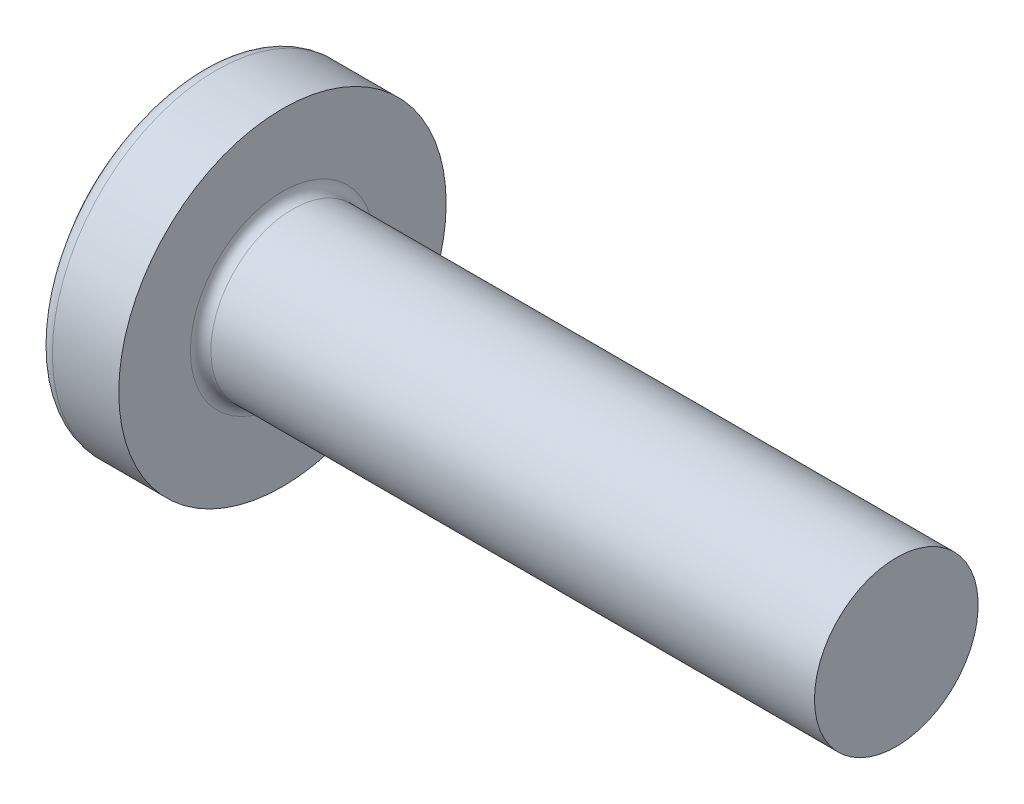
ISO-10303-21;
HEADER;
FILE_DESCRIPTION(('STEP AP214'),'2;1');
FILE_NAME('part.step','',(''),(''),'','','');
FILE_SCHEMA(('AUTOMOTIVE_DESIGN { 1 0 10303 214 1 1 1 1 }'));
ENDSEC;
DATA;
#1=APPLICATION_CONTEXT('core data for automotive mechanical design processes');
#2=APPLICATION_PROTOCOL_DEFINITION('international standard','automotive_design',2000,#1);
#3=PRODUCT_CONTEXT('',#1,'mechanical');
#4=PRODUCT('Part','Part','',(#3));
#5=PRODUCT_RELATED_PRODUCT_CATEGORY('part','',(#4));
#6=PRODUCT_DEFINITION_FORMATION('','',#4);
#7=PRODUCT_DEFINITION_CONTEXT('part definition',#1,'design');
#8=PRODUCT_DEFINITION('design','',#6,#7);
#9=PRODUCT_DEFINITION_SHAPE('','',#8);
#10=(LENGTH_UNIT() NAMED_UNIT(*) SI_UNIT(.MILLI.,.METRE.));
#11=(NAMED_UNIT(*) PLANE_ANGLE_UNIT() SI_UNIT($,.RADIAN.));
#12=(NAMED_UNIT(*) SI_UNIT($,.STERADIAN.) SOLID_ANGLE_UNIT());
#13=UNCERTAINTY_MEASURE_WITH_UNIT(LENGTH_MEASURE(1.E-05),#10,'distance_accuracy_value','');
#14=(GEOMETRIC_REPRESENTATION_CONTEXT(3) GLOBAL_UNCERTAINTY_ASSIGNED_CONTEXT((#13)) GLOBAL_UNIT_ASSIGNED_CONTEXT((#10,
#11,#12)) REPRESENTATION_CONTEXT('',''));
#15=CARTESIAN_POINT('',(0.,0.,0.));
#16=DIRECTION('',(0.,0.,1.));
#17=DIRECTION('',(1.,0.,0.));
#18=AXIS2_PLACEMENT_3D('',#15,#16,#17);
#19=CARTESIAN_POINT('',(2.5,0.,0.));
#20=DIRECTION('',(-1.,0.,0.));
#21=DIRECTION('',(0.,1.,0.));
#22=AXIS2_PLACEMENT_3D('',#19,#20,#21);
#23=SPHERICAL_SURFACE('',#22,2.5);
#24=CARTESIAN_POINT('',(0.532633828839689,0.,0.));
#25=DIRECTION('',(-1.,0.,0.));
#26=DIRECTION('',(0.,0.,1.));
#27=AXIS2_PLACEMENT_3D('',#24,#25,#26);
#28=CIRCLE('',#27,1.54255319148936);
#29=CARTESIAN_POINT('',(0.532633828839689,0.,1.54255319148936));
#30=VERTEX_POINT('',#29);
#31=EDGE_CURVE('E241',#30,#30,#28,.T.);
#32=ORIENTED_EDGE('',*,*,#31,.T.);
#33=EDGE_LOOP('',(#32));
#34=FACE_BOUND('',#33,.T.);
#35=CARTESIAN_POINT('',(0.0348536438778153,0.,0.));
#36=DIRECTION('',(1.,0.,0.));
#37=DIRECTION('',(0.,0.,-1.));
#38=AXIS2_PLACEMENT_3D('',#35,#36,#37);
#39=CIRCLE('',#38,0.415996926548163);
#40=CARTESIAN_POINT('',(0.0348536438778156,-0.239999999999999,-0.339784406495528));
#41=VERTEX_POINT('',#40);
#42=CARTESIAN_POINT('',(0.0348536438778153,-0.339784406495526,-0.24));
#43=VERTEX_POINT('',#42);
#44=EDGE_CURVE('E377',#41,#43,#39,.F.);
#45=ORIENTED_EDGE('',*,*,#44,.F.);
#46=CARTESIAN_POINT('',(2.5,-0.24,0.));
#47=DIRECTION('',(0.,1.,0.));
#48=DIRECTION('',(0.,0.,1.));
#49=AXIS2_PLACEMENT_3D('',#46,#47,#48);
#50=CIRCLE('',#49,2.48845333490504);
#51=CARTESIAN_POINT('',(0.12361367782094,-0.239999999999997,-0.738368504041365));
#52=VERTEX_POINT('',#51);
#53=EDGE_CURVE('E303',#52,#41,#50,.T.);
#54=ORIENTED_EDGE('',*,*,#53,.F.);
#55=CARTESIAN_POINT('',(2.32172308413752,0.,0.357568235162189));
#56=DIRECTION('',(0.446197753347436,0.,-0.894934391398443));
#57=DIRECTION('',(-0.894934391398443,0.,-0.446197753347436));
#58=AXIS2_PLACEMENT_3D('',#55,#56,#57);
#59=CIRCLE('',#58,2.46786594013402);
#60=CARTESIAN_POINT('',(0.12361367782094,0.240000000000003,-0.738368504041363));
#61=VERTEX_POINT('',#60);
#62=EDGE_CURVE('E275',#52,#61,#59,.T.);
#63=ORIENTED_EDGE('',*,*,#62,.T.);
#64=CARTESIAN_POINT('',(2.5,0.24,0.));
#65=DIRECTION('',(0.,-1.,0.));
#66=DIRECTION('',(0.,0.,-1.));
#67=AXIS2_PLACEMENT_3D('',#64,#65,#66);
#68=CIRCLE('',#67,2.48845333490504);
#69=CARTESIAN_POINT('',(0.0348536438778155,0.240000000000001,-0.339784406495526));
#70=VERTEX_POINT('',#69);
#71=EDGE_CURVE('E330',#70,#61,#68,.T.);
#72=ORIENTED_EDGE('',*,*,#71,.F.);
#73=CARTESIAN_POINT('',(0.0348536438778153,0.339784406495525,-0.24));
#74=VERTEX_POINT('',#73);
#75=EDGE_CURVE('E396',#74,#70,#39,.F.);
#76=ORIENTED_EDGE('',*,*,#75,.F.);
#77=CARTESIAN_POINT('',(2.5,0.,-0.24));
#78=DIRECTION('',(0.,0.,1.));
#79=DIRECTION('',(1.,0.,0.));
#80=AXIS2_PLACEMENT_3D('',#77,#78,#79);
#81=CIRCLE('',#80,2.48845333490504);
#82=CARTESIAN_POINT('',(0.12361367782094,0.738368504041364,-0.24));
#83=VERTEX_POINT('',#82);
#84=EDGE_CURVE('E269',#83,#74,#81,.T.);
#85=ORIENTED_EDGE('',*,*,#84,.F.);
#86=CARTESIAN_POINT('',(2.32172308413752,-0.357568235162189,0.));
#87=DIRECTION('',(0.446197753347436,0.894934391398443,0.));
#88=DIRECTION('',(-0.894934391398443,0.446197753347436,0.));
#89=AXIS2_PLACEMENT_3D('',#86,#87,#88);
#90=CIRCLE('',#89,2.46786594013402);
#91=CARTESIAN_POINT('',(0.12361367782094,0.738368504041364,0.24));
#92=VERTEX_POINT('',#91);
#93=EDGE_CURVE('E272',#83,#92,#90,.T.);
#94=ORIENTED_EDGE('',*,*,#93,.T.);
#95=CARTESIAN_POINT('',(2.5,0.,0.24));
#96=DIRECTION('',(0.,0.,-1.));
#97=DIRECTION('',(0.,1.,0.));
#98=AXIS2_PLACEMENT_3D('',#95,#96,#97);
#99=CIRCLE('',#98,2.48845333490504);
#100=CARTESIAN_POINT('',(0.0348536438778153,0.339784406495525,0.24));
#101=VERTEX_POINT('',#100);
#102=EDGE_CURVE('E265',#101,#92,#99,.T.);
#103=ORIENTED_EDGE('',*,*,#102,.F.);
#104=CARTESIAN_POINT('',(0.0348536438778156,0.239999999999999,0.339784406495528));
#105=VERTEX_POINT('',#104);
#106=EDGE_CURVE('E395',#105,#101,#39,.F.);
#107=ORIENTED_EDGE('',*,*,#106,.F.);
#108=CARTESIAN_POINT('',(0.12361367782094,0.239999999999997,0.738368504041365));
#109=VERTEX_POINT('',#108);
#110=EDGE_CURVE('E285',#109,#105,#68,.T.);
#111=ORIENTED_EDGE('',*,*,#110,.F.);
#112=CARTESIAN_POINT('',(2.32172308413752,0.,-0.357568235162189));
#113=DIRECTION('',(0.446197753347436,0.,0.894934391398443));
#114=DIRECTION('',(0.894934391398443,0.,-0.446197753347436));
#115=AXIS2_PLACEMENT_3D('',#112,#113,#114);
#116=CIRCLE('',#115,2.46786594013402);
#117=CARTESIAN_POINT('',(0.12361367782094,-0.240000000000002,0.738368504041363));
#118=VERTEX_POINT('',#117);
#119=EDGE_CURVE('E52',#109,#118,#116,.T.);
#120=ORIENTED_EDGE('',*,*,#119,.T.);
#121=CARTESIAN_POINT('',(0.0348536438778154,-0.240000000000001,0.339784406495526));
#122=VERTEX_POINT('',#121);
#123=EDGE_CURVE('E282',#122,#118,#50,.T.);
#124=ORIENTED_EDGE('',*,*,#123,.F.);
#125=CARTESIAN_POINT('',(0.0348536438778153,-0.339784406495526,0.24));
#126=VERTEX_POINT('',#125);
#127=EDGE_CURVE('E435',#126,#122,#39,.F.);
#128=ORIENTED_EDGE('',*,*,#127,.F.);
#129=CARTESIAN_POINT('',(0.12361367782094,-0.738368504041364,0.24));
#130=VERTEX_POINT('',#129);
#131=EDGE_CURVE('E266',#130,#126,#99,.T.);
#132=ORIENTED_EDGE('',*,*,#131,.F.);
#133=CARTESIAN_POINT('',(2.32172308413752,0.357568235162189,0.));
#134=DIRECTION('',(0.446197753347436,-0.894934391398443,0.));
#135=DIRECTION('',(0.894934391398443,0.446197753347436,0.));
#136=AXIS2_PLACEMENT_3D('',#133,#134,#135);
#137=CIRCLE('',#136,2.46786594013402);
#138=CARTESIAN_POINT('',(0.12361367782094,-0.738368504041364,-0.24));
#139=VERTEX_POINT('',#138);
#140=EDGE_CURVE('E262',#130,#139,#137,.T.);
#141=ORIENTED_EDGE('',*,*,#140,.T.);
#142=EDGE_CURVE('E67',#43,#139,#81,.T.);
#143=ORIENTED_EDGE('',*,*,#142,.F.);
#144=EDGE_LOOP('',(#45,#54,#63,#72,#76,#85,#94,#103,#107,#111,#120,#124,#128,#132,#141,#143));
#145=FACE_BOUND('',#144,.T.);
#146=ADVANCED_FACE('F38',(#34,#145),#23,.T.);
#147=CARTESIAN_POINT('',(0.,0.8,-0.24));
#148=DIRECTION('',(0.,0.,1.));
#149=DIRECTION('',(1.,0.,0.));
#150=AXIS2_PLACEMENT_3D('',#147,#148,#149);
#151=PLANE('',#150);
#152=ORIENTED_EDGE('',*,*,#84,.T.);
#153=CARTESIAN_POINT('',(-0.629305626090504,0.395285037112982,-0.24));
#154=CARTESIAN_POINT('',(-0.502245440869323,0.384885761504805,-0.24));
#155=CARTESIAN_POINT('',(-0.375193303991233,0.374386041200533,-0.24));
#156=CARTESIAN_POINT('',(-0.121109362358297,0.353102592236972,-0.24));
#157=CARTESIAN_POINT('',(0.00592244174753981,0.342318855839852,-0.24));
#158=CARTESIAN_POINT('',(0.259954553132912,0.320384813741064,-0.24));
#159=CARTESIAN_POINT('',(0.386954860411928,0.309234508033358,-0.24));
#160=CARTESIAN_POINT('',(0.640908035068628,0.286428502217992,-0.24));
#161=CARTESIAN_POINT('',(0.767860903211904,0.274772810656204,-0.24));
#162=CARTESIAN_POINT('',(1.02740505364566,0.25019581365541,-0.24));
#163=CARTESIAN_POINT('',(1.15999322223084,0.23724116727319,-0.24));
#164=CARTESIAN_POINT('',(1.35878055743683,0.216851377657761,-0.24));
#165=CARTESIAN_POINT('',(1.42502853887615,0.209894992147932,-0.24));
#166=CARTESIAN_POINT('',(1.55747716895954,0.195536747895868,-0.24));
#167=CARTESIAN_POINT('',(1.62367781680678,0.18813488182494,-0.24));
#168=CARTESIAN_POINT('',(1.68984631429487,0.180447253558898,-0.24));
#169=B_SPLINE_CURVE_WITH_KNOTS('',3,(#153,#154,#155,#156,#157,#158,#159,#160,#161,#162,#163,
#164,#165,#166,#167,#168),.UNSPECIFIED.,.F.,.F.,(4,2,2,2,2,2,2,4),(0.,0.382455333743982,
0.764921098031735,1.14738686861956,1.52984617438513,1.92950045825533,2.12933578679647,
2.32917440376968),.UNSPECIFIED.);
#170=CARTESIAN_POINT('',(0.9,0.262259890185289,-0.24));
#171=VERTEX_POINT('',#170);
#172=EDGE_CURVE('E419',#74,#171,#169,.T.);
#173=ORIENTED_EDGE('',*,*,#172,.T.);
#174=DIRECTION('',(0.,1.,0.));
#175=VECTOR('',#174,1.);
#176=CARTESIAN_POINT('',(0.9,-0.351276627792593,-0.24));
#177=LINE('',#176,#175);
#178=CARTESIAN_POINT('',(0.9,0.351276627792593,-0.24));
#179=VERTEX_POINT('',#178);
#180=EDGE_CURVE('E359',#171,#179,#177,.T.);
#181=ORIENTED_EDGE('',*,*,#180,.T.);
#182=DIRECTION('',(0.894934391398443,-0.446197753347436,0.));
#183=VECTOR('',#182,1.);
#184=CARTESIAN_POINT('',(0.,0.8,-0.24));
#185=LINE('',#184,#183);
#186=EDGE_CURVE('E242',#83,#179,#185,.T.);
#187=ORIENTED_EDGE('',*,*,#186,.F.);
#188=EDGE_LOOP('',(#152,#173,#181,#187));
#189=FACE_BOUND('',#188,.T.);
#190=ADVANCED_FACE('F197',(#189),#151,.T.);
#191=CARTESIAN_POINT('',(0.9,-0.351276627792593,-0.24));
#192=VERTEX_POINT('',#191);
#193=CARTESIAN_POINT('',(0.9,-0.262259890185289,-0.24));
#194=VERTEX_POINT('',#193);
#195=EDGE_CURVE('E250',#192,#194,#177,.T.);
#196=ORIENTED_EDGE('',*,*,#195,.T.);
#197=CARTESIAN_POINT('',(-0.629305626090504,-0.395285037112982,-0.24));
#198=CARTESIAN_POINT('',(-0.502245440869323,-0.384885761504805,-0.24));
#199=CARTESIAN_POINT('',(-0.375193303991233,-0.374386041200533,-0.24));
#200=CARTESIAN_POINT('',(-0.121109362358296,-0.353102592236972,-0.24));
#201=CARTESIAN_POINT('',(0.00592244174753997,-0.342318855839852,-0.24));
#202=CARTESIAN_POINT('',(0.259954553132912,-0.320384813741064,-0.24));
#203=CARTESIAN_POINT('',(0.386954860411928,-0.309234508033358,-0.24));
#204=CARTESIAN_POINT('',(0.640908035068629,-0.286428502217992,-0.24));
#205=CARTESIAN_POINT('',(0.767860903211904,-0.274772810656204,-0.24));
#206=CARTESIAN_POINT('',(1.02740505364565,-0.250195813655411,-0.24));
#207=CARTESIAN_POINT('',(1.15999322223082,-0.237241167273191,-0.24));
#208=CARTESIAN_POINT('',(1.35878055743681,-0.216851377657763,-0.24));
#209=CARTESIAN_POINT('',(1.42502853887612,-0.209894992147935,-0.24));
#210=CARTESIAN_POINT('',(1.55747716895951,-0.195536747895872,-0.24));
#211=CARTESIAN_POINT('',(1.62367781680675,-0.188134881824944,-0.24));
#212=CARTESIAN_POINT('',(1.68984631429483,-0.180447253558903,-0.24));
#213=B_SPLINE_CURVE_WITH_KNOTS('',3,(#197,#198,#199,#200,#201,#202,#203,#204,#205,#206,#207,
#208,#209,#210,#211,#212),.UNSPECIFIED.,.F.,.F.,(4,2,2,2,2,2,2,4),(0.,0.382455333743982,
0.764921098031735,1.14738686861956,1.52984617438513,1.92950045825531,2.12933578679643,
2.32917440376964),.UNSPECIFIED.);
#214=EDGE_CURVE('E394',#194,#43,#213,.F.);
#215=ORIENTED_EDGE('',*,*,#214,.T.);
#216=ORIENTED_EDGE('',*,*,#142,.T.);
#217=DIRECTION('',(0.894934391398443,0.446197753347436,0.));
#218=VECTOR('',#217,1.);
#219=CARTESIAN_POINT('',(0.,-0.8,-0.24));
#220=LINE('',#219,#218);
#221=EDGE_CURVE('E333',#139,#192,#220,.T.);
#222=ORIENTED_EDGE('',*,*,#221,.T.);
#223=EDGE_LOOP('',(#196,#215,#216,#222));
#224=FACE_BOUND('',#223,.T.);
#225=ADVANCED_FACE('F203',(#224),#151,.T.);
#226=CARTESIAN_POINT('',(0.,-0.799999999999999,0.24));
#227=DIRECTION('',(0.,0.,-1.));
#228=DIRECTION('',(0.,1.,0.));
#229=AXIS2_PLACEMENT_3D('',#226,#227,#228);
#230=PLANE('',#229);
#231=DIRECTION('',(0.,-1.,0.));
#232=VECTOR('',#231,1.);
#233=CARTESIAN_POINT('',(0.9,0.351276627792594,0.24));
#234=LINE('',#233,#232);
#235=CARTESIAN_POINT('',(0.9,0.351276627792593,0.24));
#236=VERTEX_POINT('',#235);
#237=CARTESIAN_POINT('',(0.9,0.262259890185289,0.24));
#238=VERTEX_POINT('',#237);
#239=EDGE_CURVE('E342',#236,#238,#234,.T.);
#240=ORIENTED_EDGE('',*,*,#239,.T.);
#241=CARTESIAN_POINT('',(-0.629305630567792,0.395285037479254,0.24));
#242=CARTESIAN_POINT('',(-0.502245444906562,0.384885761837513,0.24));
#243=CARTESIAN_POINT('',(-0.37519330758842,0.374386041499476,0.24));
#244=CARTESIAN_POINT('',(-0.121109365075988,0.353102592467066,0.24));
#245=CARTESIAN_POINT('',(0.00592243946929239,0.342318856034865,0.24));
#246=CARTESIAN_POINT('',(0.259954552394605,0.320384813806507,0.24));
#247=CARTESIAN_POINT('',(0.386954860773954,0.309234508002403,0.24));
#248=CARTESIAN_POINT('',(0.640908037631127,0.28642850198631,0.24));
#249=CARTESIAN_POINT('',(0.767860906874543,0.274772810320191,0.24));
#250=CARTESIAN_POINT('',(1.02740503497565,0.250195815411899,0.24));
#251=CARTESIAN_POINT('',(1.15999318014164,0.237241171372315,0.24));
#252=CARTESIAN_POINT('',(1.35878048026026,0.216851385682782,0.24));
#253=CARTESIAN_POINT('',(1.42502845000982,0.209895001550346,0.24));
#254=CARTESIAN_POINT('',(1.55747705673949,0.195536760284768,0.24));
#255=CARTESIAN_POINT('',(1.62367769292276,0.188134895822942,0.24));
#256=CARTESIAN_POINT('',(1.68984617876648,0.180447269328966,0.24));
#257=B_SPLINE_CURVE_WITH_KNOTS('',3,(#241,#242,#243,#244,#245,#246,#247,#248,#249,#250,#251,
#252,#253,#254,#255,#256),.UNSPECIFIED.,.F.,.F.,(4,2,2,2,2,2,2,4),(0.,0.382455335067977,
0.764921100678223,1.14738687457974,1.52984618366023,1.92950039692501,2.12933569015818,
2.32917427182042),.UNSPECIFIED.);
#258=EDGE_CURVE('E674',#238,#101,#257,.F.);
#259=ORIENTED_EDGE('',*,*,#258,.T.);
#260=ORIENTED_EDGE('',*,*,#102,.T.);
#261=DIRECTION('',(0.894934391398443,-0.446197753347436,0.));
#262=VECTOR('',#261,1.);
#263=CARTESIAN_POINT('',(0.,0.8,0.24));
#264=LINE('',#263,#262);
#265=EDGE_CURVE('E247',#92,#236,#264,.T.);
#266=ORIENTED_EDGE('',*,*,#265,.T.);
#267=EDGE_LOOP('',(#240,#259,#260,#266));
#268=FACE_BOUND('',#267,.T.);
#269=ADVANCED_FACE('F415',(#268),#230,.T.);
#270=ORIENTED_EDGE('',*,*,#131,.T.);
#271=CARTESIAN_POINT('',(-0.629305630567792,-0.395285037479254,0.24));
#272=CARTESIAN_POINT('',(-0.502245444906562,-0.384885761837513,0.24));
#273=CARTESIAN_POINT('',(-0.37519330758842,-0.374386041499476,0.24));
#274=CARTESIAN_POINT('',(-0.121109365075988,-0.353102592467066,0.24));
#275=CARTESIAN_POINT('',(0.00592243946929239,-0.342318856034865,0.24));
#276=CARTESIAN_POINT('',(0.259954552394605,-0.320384813806507,0.24));
#277=CARTESIAN_POINT('',(0.386954860773954,-0.309234508002403,0.24));
#278=CARTESIAN_POINT('',(0.640908037631127,-0.28642850198631,0.24));
#279=CARTESIAN_POINT('',(0.767860906874543,-0.274772810320191,0.24));
#280=CARTESIAN_POINT('',(1.02740503497565,-0.250195815411899,0.24));
#281=CARTESIAN_POINT('',(1.15999318014165,-0.237241171372315,0.24));
#282=CARTESIAN_POINT('',(1.35878048026027,-0.216851385682782,0.24));
#283=CARTESIAN_POINT('',(1.42502845000983,-0.209895001550345,0.24));
#284=CARTESIAN_POINT('',(1.55747705673949,-0.195536760284768,0.24));
#285=CARTESIAN_POINT('',(1.62367769292277,-0.188134895822941,0.24));
#286=CARTESIAN_POINT('',(1.68984617876649,-0.180447269328966,0.24));
#287=B_SPLINE_CURVE_WITH_KNOTS('',3,(#271,#272,#273,#274,#275,#276,#277,#278,#279,#280,#281,
#282,#283,#284,#285,#286),.UNSPECIFIED.,.F.,.F.,(4,2,2,2,2,2,2,4),(0.,0.382455335067977,
0.764921100678223,1.14738687457974,1.52984618366023,1.92950039692501,2.12933569015818,
2.32917427182042),.UNSPECIFIED.);
#288=CARTESIAN_POINT('',(0.9,-0.262259890185289,0.24));
#289=VERTEX_POINT('',#288);
#290=EDGE_CURVE('E436',#126,#289,#287,.T.);
#291=ORIENTED_EDGE('',*,*,#290,.T.);
#292=CARTESIAN_POINT('',(0.9,-0.351276627792593,0.24));
#293=VERTEX_POINT('',#292);
#294=EDGE_CURVE('E344',#289,#293,#234,.T.);
#295=ORIENTED_EDGE('',*,*,#294,.T.);
#296=DIRECTION('',(0.894934391398443,0.446197753347436,0.));
#297=VECTOR('',#296,1.);
#298=CARTESIAN_POINT('',(0.,-0.8,0.24));
#299=LINE('',#298,#297);
#300=EDGE_CURVE('E335',#130,#293,#299,.T.);
#301=ORIENTED_EDGE('',*,*,#300,.F.);
#302=EDGE_LOOP('',(#270,#291,#295,#301));
#303=FACE_BOUND('',#302,.T.);
#304=ADVANCED_FACE('F522',(#303),#230,.T.);
#305=CARTESIAN_POINT('',(0.9,0.351276627792594,0.24));
#306=DIRECTION('',(0.446197753347436,0.894934391398443,0.));
#307=DIRECTION('',(-0.894934391398443,0.446197753347436,0.));
#308=AXIS2_PLACEMENT_3D('',#305,#306,#307);
#309=PLANE('',#308);
#310=CARTESIAN_POINT('',(1.51667990224654,0.0438114218941496,0.));
#311=DIRECTION('',(0.446197753347436,0.894934391398443,0.));
#312=DIRECTION('',(-0.894934391398443,0.446197753347436,0.));
#313=AXIS2_PLACEMENT_3D('',#310,#311,#312);
#314=ELLIPSE('',#313,0.700087658673246,0.309289972496479);
#315=CARTESIAN_POINT('',(0.9,0.351276627792594,0.0546349775021752));
#316=VERTEX_POINT('',#315);
#317=CARTESIAN_POINT('',(0.9,0.351276627792594,-0.0546349775021753));
#318=VERTEX_POINT('',#317);
#319=EDGE_CURVE('E308',#316,#318,#314,.F.);
#320=ORIENTED_EDGE('',*,*,#319,.F.);
#321=DIRECTION('',(0.,0.,-1.));
#322=VECTOR('',#321,1.);
#323=CARTESIAN_POINT('',(0.9,0.351276627792594,0.24));
#324=LINE('',#323,#322);
#325=EDGE_CURVE('E345',#236,#316,#324,.T.);
#326=ORIENTED_EDGE('',*,*,#325,.F.);
#327=ORIENTED_EDGE('',*,*,#265,.F.);
#328=ORIENTED_EDGE('',*,*,#93,.F.);
#329=ORIENTED_EDGE('',*,*,#186,.T.);
#330=EDGE_CURVE('E347',#318,#179,#324,.T.);
#331=ORIENTED_EDGE('',*,*,#330,.F.);
#332=EDGE_LOOP('',(#320,#326,#327,#328,#329,#331));
#333=FACE_BOUND('',#332,.T.);
#334=ADVANCED_FACE('F413',(#333),#309,.F.);
#335=CARTESIAN_POINT('',(0.9,-0.351276627792593,-0.24));
#336=DIRECTION('',(0.446197753347436,-0.894934391398443,0.));
#337=DIRECTION('',(0.894934391398443,0.446197753347436,0.));
#338=AXIS2_PLACEMENT_3D('',#335,#336,#337);
#339=PLANE('',#338);
#340=CARTESIAN_POINT('',(1.51667990224654,-0.0438114218941494,0.));
#341=DIRECTION('',(0.446197753347436,-0.894934391398443,0.));
#342=DIRECTION('',(-0.894934391398443,-0.446197753347436,0.));
#343=AXIS2_PLACEMENT_3D('',#340,#341,#342);
#344=ELLIPSE('',#343,0.700087658673246,0.30928997249648);
#345=CARTESIAN_POINT('',(0.9,-0.351276627792594,-0.054634977502177));
#346=VERTEX_POINT('',#345);
#347=CARTESIAN_POINT('',(0.9,-0.351276627792594,0.0546349775021769));
#348=VERTEX_POINT('',#347);
#349=EDGE_CURVE('E676',#346,#348,#344,.F.);
#350=ORIENTED_EDGE('',*,*,#349,.F.);
#351=DIRECTION('',(0.,0.,1.));
#352=VECTOR('',#351,1.);
#353=CARTESIAN_POINT('',(0.9,-0.351276627792593,-0.24));
#354=LINE('',#353,#352);
#355=EDGE_CURVE('E338',#192,#346,#354,.T.);
#356=ORIENTED_EDGE('',*,*,#355,.F.);
#357=ORIENTED_EDGE('',*,*,#221,.F.);
#358=ORIENTED_EDGE('',*,*,#140,.F.);
#359=ORIENTED_EDGE('',*,*,#300,.T.);
#360=EDGE_CURVE('E341',#348,#293,#354,.T.);
#361=ORIENTED_EDGE('',*,*,#360,.F.);
#362=EDGE_LOOP('',(#350,#356,#357,#358,#359,#361));
#363=FACE_BOUND('',#362,.T.);
#364=ADVANCED_FACE('F509',(#363),#339,.F.);
#365=CARTESIAN_POINT('',(0.9,0.351276627792593,-0.24));
#366=DIRECTION('',(-1.,0.,0.));
#367=DIRECTION('',(0.,0.,1.));
#368=AXIS2_PLACEMENT_3D('',#365,#366,#367);
#369=PLANE('',#368);
#370=DIRECTION('',(0.,1.,0.));
#371=VECTOR('',#370,1.);
#372=CARTESIAN_POINT('',(0.9,-0.240000000000001,0.351276627792593));
#373=LINE('',#372,#371);
#374=CARTESIAN_POINT('',(0.9,-0.240000000000001,0.351276627792593));
#375=VERTEX_POINT('',#374);
#376=CARTESIAN_POINT('',(0.9,-0.0546349775021802,0.351276627792593));
#377=VERTEX_POINT('',#376);
#378=EDGE_CURVE('E323',#375,#377,#373,.T.);
#379=ORIENTED_EDGE('',*,*,#378,.T.);
#380=CARTESIAN_POINT('',(0.9,0.,0.));
#381=DIRECTION('',(-1.,0.,0.));
#382=DIRECTION('',(0.,0.,1.));
#383=AXIS2_PLACEMENT_3D('',#380,#381,#382);
#384=CIRCLE('',#383,0.3555);
#385=CARTESIAN_POINT('',(0.9,-0.240000000000001,0.262259890185289));
#386=VERTEX_POINT('',#385);
#387=EDGE_CURVE('E704',#386,#377,#384,.T.);
#388=ORIENTED_EDGE('',*,*,#387,.F.);
#389=DIRECTION('',(0.,0.,-1.));
#390=VECTOR('',#389,1.);
#391=CARTESIAN_POINT('',(0.9,-0.240000000000001,0.351276627792593));
#392=LINE('',#391,#390);
#393=EDGE_CURVE('E319',#375,#386,#392,.T.);
#394=ORIENTED_EDGE('',*,*,#393,.F.);
#395=EDGE_LOOP('',(#379,#388,#394));
#396=FACE_BOUND('',#395,.T.);
#397=ADVANCED_FACE('F502',(#396),#369,.T.);
#398=ORIENTED_EDGE('',*,*,#294,.F.);
#399=EDGE_CURVE('E709',#348,#289,#384,.T.);
#400=ORIENTED_EDGE('',*,*,#399,.F.);
#401=ORIENTED_EDGE('',*,*,#360,.T.);
#402=EDGE_LOOP('',(#398,#400,#401));
#403=FACE_BOUND('',#402,.T.);
#404=ADVANCED_FACE('F495',(#403),#369,.T.);
#405=ORIENTED_EDGE('',*,*,#355,.T.);
#406=EDGE_CURVE('E388',#194,#346,#384,.T.);
#407=ORIENTED_EDGE('',*,*,#406,.F.);
#408=ORIENTED_EDGE('',*,*,#195,.F.);
#409=EDGE_LOOP('',(#405,#407,#408));
#410=FACE_BOUND('',#409,.T.);
#411=ADVANCED_FACE('F489',(#410),#369,.T.);
#412=CARTESIAN_POINT('',(0.9,-0.239999999999999,-0.262259890185289));
#413=VERTEX_POINT('',#412);
#414=CARTESIAN_POINT('',(0.9,-0.239999999999999,-0.351276627792594));
#415=VERTEX_POINT('',#414);
#416=EDGE_CURVE('E322',#413,#415,#392,.T.);
#417=ORIENTED_EDGE('',*,*,#416,.F.);
#418=CARTESIAN_POINT('',(0.9,-0.0546349775021794,-0.351276627792594));
#419=VERTEX_POINT('',#418);
#420=EDGE_CURVE('E59',#419,#413,#384,.T.);
#421=ORIENTED_EDGE('',*,*,#420,.F.);
#422=DIRECTION('',(0.,-1.,0.));
#423=VECTOR('',#422,1.);
#424=CARTESIAN_POINT('',(0.9,0.240000000000001,-0.351276627792592));
#425=LINE('',#424,#423);
#426=EDGE_CURVE('E318',#419,#415,#425,.T.);
#427=ORIENTED_EDGE('',*,*,#426,.T.);
#428=EDGE_LOOP('',(#417,#421,#427));
#429=FACE_BOUND('',#428,.T.);
#430=ADVANCED_FACE('F383',(#429),#369,.T.);
#431=CARTESIAN_POINT('',(0.9,0.240000000000001,-0.351276627792592));
#432=VERTEX_POINT('',#431);
#433=CARTESIAN_POINT('',(0.9,0.054634977502182,-0.351276627792593));
#434=VERTEX_POINT('',#433);
#435=EDGE_CURVE('E315',#432,#434,#425,.T.);
#436=ORIENTED_EDGE('',*,*,#435,.T.);
#437=CARTESIAN_POINT('',(0.9,0.240000000000001,-0.262259890185289));
#438=VERTEX_POINT('',#437);
#439=EDGE_CURVE('E387',#438,#434,#384,.T.);
#440=ORIENTED_EDGE('',*,*,#439,.F.);
#441=DIRECTION('',(0.,0.,1.));
#442=VECTOR('',#441,1.);
#443=CARTESIAN_POINT('',(0.9,0.240000000000001,-0.351276627792592));
#444=LINE('',#443,#442);
#445=EDGE_CURVE('E327',#432,#438,#444,.T.);
#446=ORIENTED_EDGE('',*,*,#445,.F.);
#447=EDGE_LOOP('',(#436,#440,#446));
#448=FACE_BOUND('',#447,.T.);
#449=ADVANCED_FACE('F477',(#448),#369,.T.);
#450=ORIENTED_EDGE('',*,*,#180,.F.);
#451=EDGE_CURVE('E693',#318,#171,#384,.T.);
#452=ORIENTED_EDGE('',*,*,#451,.F.);
#453=ORIENTED_EDGE('',*,*,#330,.T.);
#454=EDGE_LOOP('',(#450,#452,#453));
#455=FACE_BOUND('',#454,.T.);
#456=ADVANCED_FACE('F470',(#455),#369,.T.);
#457=ORIENTED_EDGE('',*,*,#325,.T.);
#458=EDGE_CURVE('E695',#238,#316,#384,.T.);
#459=ORIENTED_EDGE('',*,*,#458,.F.);
#460=ORIENTED_EDGE('',*,*,#239,.F.);
#461=EDGE_LOOP('',(#457,#459,#460));
#462=FACE_BOUND('',#461,.T.);
#463=ADVANCED_FACE('F464',(#462),#369,.T.);
#464=CARTESIAN_POINT('',(0.,0.239999999999997,0.8));
#465=DIRECTION('',(0.,-1.,0.));
#466=DIRECTION('',(1.,0.,0.));
#467=AXIS2_PLACEMENT_3D('',#464,#465,#466);
#468=PLANE('',#467);
#469=ORIENTED_EDGE('',*,*,#110,.T.);
#470=CARTESIAN_POINT('',(-0.629305626090504,0.239999999999999,0.395285037112982));
#471=CARTESIAN_POINT('',(-0.502245440869323,0.239999999999999,0.384885761504806));
#472=CARTESIAN_POINT('',(-0.375193303991233,0.239999999999999,0.374386041200533));
#473=CARTESIAN_POINT('',(-0.121109362358296,0.239999999999999,0.353102592236972));
#474=CARTESIAN_POINT('',(0.00592244174753997,0.239999999999999,0.342318855839852));
#475=CARTESIAN_POINT('',(0.259954553132912,0.239999999999999,0.320384813741065));
#476=CARTESIAN_POINT('',(0.386954860411928,0.239999999999999,0.309234508033359));
#477=CARTESIAN_POINT('',(0.640908035068629,0.239999999999999,0.286428502217993));
#478=CARTESIAN_POINT('',(0.767860903211904,0.239999999999999,0.274772810656205));
#479=CARTESIAN_POINT('',(1.02740505364566,0.239999999999999,0.250195813655411));
#480=CARTESIAN_POINT('',(1.15999322223084,0.239999999999999,0.237241167273191));
#481=CARTESIAN_POINT('',(1.35878055743683,0.239999999999999,0.216851377657762));
#482=CARTESIAN_POINT('',(1.42502853887615,0.239999999999999,0.209894992147933));
#483=CARTESIAN_POINT('',(1.55747716895955,0.239999999999999,0.195536747895869));
#484=CARTESIAN_POINT('',(1.62367781680678,0.239999999999999,0.188134881824941));
#485=CARTESIAN_POINT('',(1.68984631429487,0.239999999999999,0.180447253558899));
#486=B_SPLINE_CURVE_WITH_KNOTS('',3,(#470,#471,#472,#473,#474,#475,#476,#477,#478,#479,#480,
#481,#482,#483,#484,#485),.UNSPECIFIED.,.F.,.F.,(4,2,2,2,2,2,2,4),(0.,0.382455333743982,
0.764921098031735,1.14738686861956,1.52984617438513,1.92950045825533,2.12933578679647,
2.32917440376968),.UNSPECIFIED.);
#487=CARTESIAN_POINT('',(0.9,0.239999999999999,0.26225989018529));
#488=VERTEX_POINT('',#487);
#489=EDGE_CURVE('E673',#105,#488,#486,.T.);
#490=ORIENTED_EDGE('',*,*,#489,.T.);
#491=CARTESIAN_POINT('',(0.9,0.239999999999999,0.351276627792594));
#492=VERTEX_POINT('',#491);
#493=EDGE_CURVE('E300',#488,#492,#444,.T.);
#494=ORIENTED_EDGE('',*,*,#493,.T.);
#495=DIRECTION('',(0.894934391398443,0.,-0.446197753347436));
#496=VECTOR('',#495,1.);
#497=CARTESIAN_POINT('',(0.,0.239999999999997,0.800000000000001));
#498=LINE('',#497,#496);
#499=EDGE_CURVE('E293',#109,#492,#498,.T.);
#500=ORIENTED_EDGE('',*,*,#499,.F.);
#501=EDGE_LOOP('',(#469,#490,#494,#500));
#502=FACE_BOUND('',#501,.T.);
#503=ADVANCED_FACE('F297',(#502),#468,.T.);
#504=CARTESIAN_POINT('',(0.,-0.239999999999997,-0.8));
#505=DIRECTION('',(0.,1.,0.));
#506=DIRECTION('',(0.,0.,1.));
#507=AXIS2_PLACEMENT_3D('',#504,#505,#506);
#508=PLANE('',#507);
#509=ORIENTED_EDGE('',*,*,#393,.T.);
#510=CARTESIAN_POINT('',(-0.629305630567792,-0.240000000000001,0.395285037479253));
#511=CARTESIAN_POINT('',(-0.502245444906562,-0.240000000000001,0.384885761837512));
#512=CARTESIAN_POINT('',(-0.375193307588421,-0.240000000000001,0.374386041499475));
#513=CARTESIAN_POINT('',(-0.121109365075988,-0.240000000000001,0.353102592467065));
#514=CARTESIAN_POINT('',(0.00592243946929229,-0.240000000000001,0.342318856034864));
#515=CARTESIAN_POINT('',(0.259954552394605,-0.240000000000001,0.320384813806506));
#516=CARTESIAN_POINT('',(0.386954860773954,-0.240000000000001,0.309234508002402));
#517=CARTESIAN_POINT('',(0.640908037631128,-0.240000000000001,0.286428501986309));
#518=CARTESIAN_POINT('',(0.767860906874543,-0.240000000000001,0.27477281032019));
#519=CARTESIAN_POINT('',(1.02740503497565,-0.240000000000001,0.250195815411898));
#520=CARTESIAN_POINT('',(1.15999318014165,-0.240000000000001,0.237241171372314));
#521=CARTESIAN_POINT('',(1.35878048026027,-0.240000000000001,0.216851385682781));
#522=CARTESIAN_POINT('',(1.42502845000983,-0.240000000000001,0.209895001550344));
#523=CARTESIAN_POINT('',(1.5574770567395,-0.240000000000001,0.195536760284766));
#524=CARTESIAN_POINT('',(1.62367769292277,-0.240000000000001,0.18813489582294));
#525=CARTESIAN_POINT('',(1.68984617876649,-0.240000000000001,0.180447269328964));
#526=B_SPLINE_CURVE_WITH_KNOTS('',3,(#510,#511,#512,#513,#514,#515,#516,#517,#518,#519,#520,
#521,#522,#523,#524,#525),.UNSPECIFIED.,.F.,.F.,(4,2,2,2,2,2,2,4),(0.,0.382455335067977,
0.764921100678223,1.14738687457974,1.52984618366023,1.92950039692502,2.12933569015819,
2.32917427182043),.UNSPECIFIED.);
#527=EDGE_CURVE('E428',#386,#122,#526,.F.);
#528=ORIENTED_EDGE('',*,*,#527,.T.);
#529=ORIENTED_EDGE('',*,*,#123,.T.);
#530=DIRECTION('',(0.894934391398443,0.,-0.446197753347436));
#531=VECTOR('',#530,1.);
#532=CARTESIAN_POINT('',(0.,-0.240000000000003,0.799999999999999));
#533=LINE('',#532,#531);
#534=EDGE_CURVE('E295',#118,#375,#533,.T.);
#535=ORIENTED_EDGE('',*,*,#534,.T.);
#536=EDGE_LOOP('',(#509,#528,#529,#535));
#537=FACE_BOUND('',#536,.T.);
#538=ADVANCED_FACE('F232',(#537),#508,.T.);
#539=CARTESIAN_POINT('',(0.9,-0.240000000000001,0.351276627792593));
#540=DIRECTION('',(0.446197753347436,0.,0.894934391398443));
#541=DIRECTION('',(-0.894934391398443,0.,0.446197753347436));
#542=AXIS2_PLACEMENT_3D('',#539,#540,#541);
#543=PLANE('',#542);
#544=CARTESIAN_POINT('',(1.51667990224654,0.,0.0438114218941495));
#545=DIRECTION('',(0.446197753347436,0.,0.894934391398443));
#546=DIRECTION('',(-0.894934391398443,0.,0.446197753347436));
#547=AXIS2_PLACEMENT_3D('',#544,#545,#546);
#548=ELLIPSE('',#547,0.700087658673246,0.30928997249648);
#549=CARTESIAN_POINT('',(0.9,0.0546349775021778,0.351276627792594));
#550=VERTEX_POINT('',#549);
#551=EDGE_CURVE('E426',#377,#550,#548,.F.);
#552=ORIENTED_EDGE('',*,*,#551,.F.);
#553=ORIENTED_EDGE('',*,*,#378,.F.);
#554=ORIENTED_EDGE('',*,*,#534,.F.);
#555=ORIENTED_EDGE('',*,*,#119,.F.);
#556=ORIENTED_EDGE('',*,*,#499,.T.);
#557=EDGE_CURVE('E326',#550,#492,#373,.T.);
#558=ORIENTED_EDGE('',*,*,#557,.F.);
#559=EDGE_LOOP('',(#552,#553,#554,#555,#556,#558));
#560=FACE_BOUND('',#559,.T.);
#561=ADVANCED_FACE('F291',(#560),#543,.F.);
#562=CARTESIAN_POINT('',(0.9,0.240000000000001,-0.351276627792592));
#563=DIRECTION('',(0.446197753347436,0.,-0.894934391398443));
#564=DIRECTION('',(0.894934391398443,0.,0.446197753347436));
#565=AXIS2_PLACEMENT_3D('',#562,#563,#564);
#566=PLANE('',#565);
#567=CARTESIAN_POINT('',(1.51667990224654,0.,-0.0438114218941494));
#568=DIRECTION('',(0.446197753347436,0.,-0.894934391398443));
#569=DIRECTION('',(-0.894934391398443,0.,-0.446197753347436));
#570=AXIS2_PLACEMENT_3D('',#567,#568,#569);
#571=ELLIPSE('',#570,0.700087658673246,0.30928997249648);
#572=EDGE_CURVE('E381',#434,#419,#571,.F.);
#573=ORIENTED_EDGE('',*,*,#572,.F.);
#574=ORIENTED_EDGE('',*,*,#435,.F.);
#575=DIRECTION('',(0.894934391398443,0.,0.446197753347436));
#576=VECTOR('',#575,1.);
#577=CARTESIAN_POINT('',(0.,0.240000000000003,-0.799999999999999));
#578=LINE('',#577,#576);
#579=EDGE_CURVE('E305',#61,#432,#578,.T.);
#580=ORIENTED_EDGE('',*,*,#579,.F.);
#581=ORIENTED_EDGE('',*,*,#62,.F.);
#582=DIRECTION('',(0.894934391398443,0.,0.446197753347436));
#583=VECTOR('',#582,1.);
#584=CARTESIAN_POINT('',(0.,-0.239999999999997,-0.800000000000001));
#585=LINE('',#584,#583);
#586=EDGE_CURVE('E312',#52,#415,#585,.T.);
#587=ORIENTED_EDGE('',*,*,#586,.T.);
#588=ORIENTED_EDGE('',*,*,#426,.F.);
#589=EDGE_LOOP('',(#573,#574,#580,#581,#587,#588));
#590=FACE_BOUND('',#589,.T.);
#591=ADVANCED_FACE('F372',(#590),#566,.F.);
#592=ORIENTED_EDGE('',*,*,#445,.T.);
#593=CARTESIAN_POINT('',(-0.629305630567792,0.240000000000001,-0.395285037479253));
#594=CARTESIAN_POINT('',(-0.502245444906562,0.240000000000001,-0.384885761837512));
#595=CARTESIAN_POINT('',(-0.37519330758842,0.240000000000001,-0.374386041499475));
#596=CARTESIAN_POINT('',(-0.121109365075988,0.240000000000001,-0.353102592467065));
#597=CARTESIAN_POINT('',(0.00592243946929239,0.240000000000001,-0.342318856034864));
#598=CARTESIAN_POINT('',(0.259954552394605,0.240000000000001,-0.320384813806506));
#599=CARTESIAN_POINT('',(0.386954860773954,0.240000000000001,-0.309234508002402));
#600=CARTESIAN_POINT('',(0.640908037631127,0.240000000000001,-0.286428501986309));
#601=CARTESIAN_POINT('',(0.767860906874543,0.240000000000001,-0.27477281032019));
#602=CARTESIAN_POINT('',(1.02740503497566,0.240000000000001,-0.250195815411898));
#603=CARTESIAN_POINT('',(1.15999318014166,0.240000000000001,-0.237241171372313));
#604=CARTESIAN_POINT('',(1.35878048026028,0.240000000000001,-0.216851385682779));
#605=CARTESIAN_POINT('',(1.42502845000985,0.240000000000001,-0.209895001550342));
#606=CARTESIAN_POINT('',(1.55747705673952,0.240000000000001,-0.195536760284764));
#607=CARTESIAN_POINT('',(1.6236776929228,0.240000000000001,-0.188134895822937));
#608=CARTESIAN_POINT('',(1.68984617876652,0.240000000000001,-0.180447269328961));
#609=B_SPLINE_CURVE_WITH_KNOTS('',3,(#593,#594,#595,#596,#597,#598,#599,#600,#601,#602,#603,
#604,#605,#606,#607,#608),.UNSPECIFIED.,.F.,.F.,(4,2,2,2,2,2,2,4),(0.,0.382455335067977,
0.764921100678223,1.14738687457974,1.52984618366023,1.92950039692503,2.12933569015821,
2.32917427182045),.UNSPECIFIED.);
#610=EDGE_CURVE('E368',#438,#70,#609,.F.);
#611=ORIENTED_EDGE('',*,*,#610,.T.);
#612=ORIENTED_EDGE('',*,*,#71,.T.);
#613=ORIENTED_EDGE('',*,*,#579,.T.);
#614=EDGE_LOOP('',(#592,#611,#612,#613));
#615=FACE_BOUND('',#614,.T.);
#616=ADVANCED_FACE('F230',(#615),#468,.T.);
#617=ORIENTED_EDGE('',*,*,#53,.T.);
#618=CARTESIAN_POINT('',(-0.629305626090504,-0.239999999999998,-0.395285037112983));
#619=CARTESIAN_POINT('',(-0.502245440869323,-0.239999999999998,-0.384885761504806));
#620=CARTESIAN_POINT('',(-0.375193303991233,-0.239999999999998,-0.374386041200534));
#621=CARTESIAN_POINT('',(-0.121109362358297,-0.239999999999999,-0.353102592236972));
#622=CARTESIAN_POINT('',(0.00592244174753992,-0.239999999999999,-0.342318855839853));
#623=CARTESIAN_POINT('',(0.259954553132912,-0.239999999999999,-0.320384813741065));
#624=CARTESIAN_POINT('',(0.386954860411928,-0.239999999999999,-0.309234508033359));
#625=CARTESIAN_POINT('',(0.640908035068629,-0.239999999999999,-0.286428502217993));
#626=CARTESIAN_POINT('',(0.767860903211904,-0.239999999999999,-0.274772810656205));
#627=CARTESIAN_POINT('',(1.02740505364565,-0.239999999999999,-0.250195813655411));
#628=CARTESIAN_POINT('',(1.15999322223083,-0.239999999999999,-0.237241167273192));
#629=CARTESIAN_POINT('',(1.35878055743681,-0.239999999999999,-0.216851377657764));
#630=CARTESIAN_POINT('',(1.42502853887613,-0.239999999999999,-0.209894992147935));
#631=CARTESIAN_POINT('',(1.55747716895952,-0.239999999999999,-0.195536747895873));
#632=CARTESIAN_POINT('',(1.62367781680675,-0.239999999999999,-0.188134881824944));
#633=CARTESIAN_POINT('',(1.68984631429483,-0.239999999999999,-0.180447253558903));
#634=B_SPLINE_CURVE_WITH_KNOTS('',3,(#618,#619,#620,#621,#622,#623,#624,#625,#626,#627,#628,
#629,#630,#631,#632,#633),.UNSPECIFIED.,.F.,.F.,(4,2,2,2,2,2,2,4),(0.,0.382455333743982,
0.764921098031735,1.14738686861956,1.52984617438513,1.92950045825531,2.12933578679644,
2.32917440376965),.UNSPECIFIED.);
#635=EDGE_CURVE('E11',#41,#413,#634,.T.);
#636=ORIENTED_EDGE('',*,*,#635,.T.);
#637=ORIENTED_EDGE('',*,*,#416,.T.);
#638=ORIENTED_EDGE('',*,*,#586,.F.);
#639=EDGE_LOOP('',(#617,#636,#637,#638));
#640=FACE_BOUND('',#639,.T.);
#641=ADVANCED_FACE('F225',(#640),#508,.T.);
#642=CARTESIAN_POINT('',(-25.4,0.,0.));
#643=DIRECTION('',(-1.,0.,0.));
#644=DIRECTION('',(0.,0.,1.));
#645=AXIS2_PLACEMENT_3D('',#642,#643,#644);
#646=CYLINDRICAL_SURFACE('',#645,0.8);
#647=CARTESIAN_POINT('',(1.4,0.,0.));
#648=DIRECTION('',(-1.,0.,0.));
#649=DIRECTION('',(0.,0.,1.));
#650=AXIS2_PLACEMENT_3D('',#647,#648,#649);
#651=CIRCLE('',#650,0.8);
#652=CARTESIAN_POINT('',(1.4,0.,0.8));
#653=VERTEX_POINT('',#652);
#654=EDGE_CURVE('E236',#653,#653,#651,.F.);
#655=ORIENTED_EDGE('',*,*,#654,.T.);
#656=EDGE_LOOP('',(#655));
#657=FACE_BOUND('',#656,.T.);
#658=CARTESIAN_POINT('',(7.3,0.,0.));
#659=DIRECTION('',(-1.,0.,0.));
#660=DIRECTION('',(0.,0.,1.));
#661=AXIS2_PLACEMENT_3D('',#658,#659,#660);
#662=CIRCLE('',#661,0.8);
#663=CARTESIAN_POINT('',(7.3,0.,0.8));
#664=VERTEX_POINT('',#663);
#665=EDGE_CURVE('E239',#664,#664,#662,.T.);
#666=ORIENTED_EDGE('',*,*,#665,.T.);
#667=EDGE_LOOP('',(#666));
#668=FACE_BOUND('',#667,.T.);
#669=ADVANCED_FACE('F222',(#657,#668),#646,.T.);
#670=CARTESIAN_POINT('',(1.3,0.8,0.));
#671=DIRECTION('',(-1.,0.,0.));
#672=DIRECTION('',(0.,0.,1.));
#673=AXIS2_PLACEMENT_3D('',#670,#671,#672);
#674=PLANE('',#673);
#675=CARTESIAN_POINT('',(1.3,0.,0.));
#676=DIRECTION('',(-1.,0.,0.));
#677=DIRECTION('',(0.,0.,1.));
#678=AXIS2_PLACEMENT_3D('',#675,#676,#677);
#679=CIRCLE('',#678,0.9);
#680=CARTESIAN_POINT('',(1.3,0.,0.9));
#681=VERTEX_POINT('',#680);
#682=EDGE_CURVE('E258',#681,#681,#679,.T.);
#683=ORIENTED_EDGE('',*,*,#682,.T.);
#684=EDGE_LOOP('',(#683));
#685=FACE_BOUND('',#684,.T.);
#686=CARTESIAN_POINT('',(1.3,0.,0.));
#687=DIRECTION('',(-1.,0.,0.));
#688=DIRECTION('',(0.,0.,1.));
#689=AXIS2_PLACEMENT_3D('',#686,#687,#688);
#690=CIRCLE('',#689,1.6);
#691=CARTESIAN_POINT('',(1.3,0.,1.6));
#692=VERTEX_POINT('',#691);
#693=EDGE_CURVE('E255',#692,#692,#690,.T.);
#694=ORIENTED_EDGE('',*,*,#693,.F.);
#695=EDGE_LOOP('',(#694));
#696=FACE_BOUND('',#695,.T.);
#697=ADVANCED_FACE('F219',(#685,#696),#674,.F.);
#698=CARTESIAN_POINT('',(-25.4,0.,0.));
#699=DIRECTION('',(-1.,0.,0.));
#700=DIRECTION('',(0.,0.,1.));
#701=AXIS2_PLACEMENT_3D('',#698,#699,#700);
#702=CYLINDRICAL_SURFACE('',#701,1.6);
#703=ORIENTED_EDGE('',*,*,#693,.T.);
#704=EDGE_LOOP('',(#703));
#705=FACE_BOUND('',#704,.T.);
#706=CARTESIAN_POINT('',(0.650675799109306,0.,0.));
#707=DIRECTION('',(-1.,0.,0.));
#708=DIRECTION('',(0.,0.,1.));
#709=AXIS2_PLACEMENT_3D('',#706,#707,#708);
#710=CIRCLE('',#709,1.6);
#711=CARTESIAN_POINT('',(0.650675799109306,0.,1.6));
#712=VERTEX_POINT('',#711);
#713=EDGE_CURVE('E244',#712,#712,#710,.T.);
#714=ORIENTED_EDGE('',*,*,#713,.F.);
#715=EDGE_LOOP('',(#714));
#716=FACE_BOUND('',#715,.T.);
#717=ADVANCED_FACE('F215',(#705,#716),#702,.T.);
#718=CARTESIAN_POINT('',(0.650675799109308,0.,0.));
#719=DIRECTION('',(-1.,0.,0.));
#720=DIRECTION('',(0.,0.,1.));
#721=AXIS2_PLACEMENT_3D('',#718,#719,#720);
#722=TOROIDAL_SURFACE('',#721,1.45,0.15);
#723=ORIENTED_EDGE('',*,*,#713,.T.);
#724=EDGE_LOOP('',(#723));
#725=FACE_BOUND('',#724,.T.);
#726=ORIENTED_EDGE('',*,*,#31,.F.);
#727=EDGE_LOOP('',(#726));
#728=FACE_BOUND('',#727,.T.);
#729=ADVANCED_FACE('F212',(#725,#728),#722,.T.);
#730=CARTESIAN_POINT('',(7.3,0.8,0.));
#731=DIRECTION('',(1.,0.,0.));
#732=DIRECTION('',(0.,0.,-1.));
#733=AXIS2_PLACEMENT_3D('',#730,#731,#732);
#734=PLANE('',#733);
#735=ORIENTED_EDGE('',*,*,#665,.F.);
#736=EDGE_LOOP('',(#735));
#737=FACE_BOUND('',#736,.T.);
#738=ADVANCED_FACE('F210',(#737),#734,.T.);
#739=CARTESIAN_POINT('',(1.4,0.,0.));
#740=DIRECTION('',(-1.,0.,0.));
#741=DIRECTION('',(0.,0.,1.));
#742=AXIS2_PLACEMENT_3D('',#739,#740,#741);
#743=TOROIDAL_SURFACE('',#742,0.9,0.1);
#744=ORIENTED_EDGE('',*,*,#654,.F.);
#745=EDGE_LOOP('',(#744));
#746=FACE_BOUND('',#745,.T.);
#747=ORIENTED_EDGE('',*,*,#682,.F.);
#748=EDGE_LOOP('',(#747));
#749=FACE_BOUND('',#748,.T.);
#750=ADVANCED_FACE('F40',(#746,#749),#743,.F.);
#751=ORIENTED_EDGE('',*,*,#493,.F.);
#752=EDGE_CURVE('E389',#550,#488,#384,.T.);
#753=ORIENTED_EDGE('',*,*,#752,.F.);
#754=ORIENTED_EDGE('',*,*,#557,.T.);
#755=EDGE_LOOP('',(#751,#753,#754));
#756=FACE_BOUND('',#755,.T.);
#757=ADVANCED_FACE('F471',(#756),#369,.T.);
#758=CARTESIAN_POINT('',(0.9,0.,0.));
#759=DIRECTION('',(-1.,0.,0.));
#760=DIRECTION('',(0.,0.,1.));
#761=AXIS2_PLACEMENT_3D('',#758,#759,#760);
#762=CONICAL_SURFACE('',#761,0.3555,0.0698131700797659);
#763=ORIENTED_EDGE('',*,*,#319,.T.);
#764=EDGE_CURVE('E690',#316,#318,#384,.T.);
#765=ORIENTED_EDGE('',*,*,#764,.F.);
#766=EDGE_LOOP('',(#763,#765));
#767=FACE_BOUND('',#766,.T.);
#768=ADVANCED_FACE('F194',(#767),#762,.F.);
#769=ORIENTED_EDGE('',*,*,#349,.T.);
#770=EDGE_CURVE('E710',#346,#348,#384,.T.);
#771=ORIENTED_EDGE('',*,*,#770,.F.);
#772=EDGE_LOOP('',(#769,#771));
#773=FACE_BOUND('',#772,.T.);
#774=ADVANCED_FACE('F604',(#773),#762,.F.);
#775=EDGE_CURVE('E391',#488,#238,#384,.T.);
#776=ORIENTED_EDGE('',*,*,#775,.F.);
#777=ORIENTED_EDGE('',*,*,#489,.F.);
#778=ORIENTED_EDGE('',*,*,#106,.T.);
#779=ORIENTED_EDGE('',*,*,#258,.F.);
#780=EDGE_LOOP('',(#776,#777,#778,#779));
#781=FACE_BOUND('',#780,.T.);
#782=ADVANCED_FACE('F610',(#781),#762,.F.);
#783=ORIENTED_EDGE('',*,*,#551,.T.);
#784=EDGE_CURVE('E392',#377,#550,#384,.T.);
#785=ORIENTED_EDGE('',*,*,#784,.F.);
#786=EDGE_LOOP('',(#783,#785));
#787=FACE_BOUND('',#786,.T.);
#788=ADVANCED_FACE('F617',(#787),#762,.F.);
#789=ORIENTED_EDGE('',*,*,#572,.T.);
#790=EDGE_CURVE('E384',#434,#419,#384,.T.);
#791=ORIENTED_EDGE('',*,*,#790,.F.);
#792=EDGE_LOOP('',(#789,#791));
#793=FACE_BOUND('',#792,.T.);
#794=ADVANCED_FACE('F624',(#793),#762,.F.);
#795=ORIENTED_EDGE('',*,*,#127,.T.);
#796=ORIENTED_EDGE('',*,*,#527,.F.);
#797=EDGE_CURVE('E706',#289,#386,#384,.T.);
#798=ORIENTED_EDGE('',*,*,#797,.F.);
#799=ORIENTED_EDGE('',*,*,#290,.F.);
#800=EDGE_LOOP('',(#795,#796,#798,#799));
#801=FACE_BOUND('',#800,.T.);
#802=ADVANCED_FACE('F631',(#801),#762,.F.);
#803=ORIENTED_EDGE('',*,*,#75,.T.);
#804=ORIENTED_EDGE('',*,*,#610,.F.);
#805=EDGE_CURVE('E696',#171,#438,#384,.T.);
#806=ORIENTED_EDGE('',*,*,#805,.F.);
#807=ORIENTED_EDGE('',*,*,#172,.F.);
#808=EDGE_LOOP('',(#803,#804,#806,#807));
#809=FACE_BOUND('',#808,.T.);
#810=ADVANCED_FACE('F192',(#809),#762,.F.);
#811=EDGE_CURVE('E385',#413,#194,#384,.T.);
#812=ORIENTED_EDGE('',*,*,#811,.F.);
#813=ORIENTED_EDGE('',*,*,#635,.F.);
#814=ORIENTED_EDGE('',*,*,#44,.T.);
#815=ORIENTED_EDGE('',*,*,#214,.F.);
#816=EDGE_LOOP('',(#812,#813,#814,#815));
#817=FACE_BOUND('',#816,.T.);
#818=ADVANCED_FACE('F187',(#817),#762,.F.);
#819=CARTESIAN_POINT('',(1.0155089520108,0.,0.));
#820=DIRECTION('',(-1.,0.,0.));
#821=DIRECTION('',(0.,0.,1.));
#822=AXIS2_PLACEMENT_3D('',#819,#820,#821);
#823=CONICAL_SURFACE('',#822,0.,1.25663706143592);
#824=ORIENTED_EDGE('',*,*,#752,.T.);
#825=ORIENTED_EDGE('',*,*,#775,.T.);
#826=ORIENTED_EDGE('',*,*,#458,.T.);
#827=ORIENTED_EDGE('',*,*,#764,.T.);
#828=ORIENTED_EDGE('',*,*,#451,.T.);
#829=ORIENTED_EDGE('',*,*,#805,.T.);
#830=ORIENTED_EDGE('',*,*,#439,.T.);
#831=ORIENTED_EDGE('',*,*,#790,.T.);
#832=ORIENTED_EDGE('',*,*,#420,.T.);
#833=ORIENTED_EDGE('',*,*,#811,.T.);
#834=ORIENTED_EDGE('',*,*,#406,.T.);
#835=ORIENTED_EDGE('',*,*,#770,.T.);
#836=ORIENTED_EDGE('',*,*,#399,.T.);
#837=ORIENTED_EDGE('',*,*,#797,.T.);
#838=ORIENTED_EDGE('',*,*,#387,.T.);
#839=ORIENTED_EDGE('',*,*,#784,.T.);
#840=EDGE_LOOP('',(#824,#825,#826,#827,#828,#829,#830,#831,#832,#833,#834,#835,#836,#837,#838,#839));
#841=FACE_BOUND('',#840,.T.);
#842=CARTESIAN_POINT('',(1.0155089520108,0.,0.));
#843=VERTEX_POINT('',#842);
#844=VERTEX_LOOP('',#843);
#845=FACE_BOUND('',#844,.T.);
#846=ADVANCED_FACE('F185',(#841,#845),#823,.F.);
#847=CLOSED_SHELL('',(#146,#190,#225,#269,#304,#334,#364,#397,#404,#411,#430,#449,#456,#463,
#503,#538,#561,#591,#616,#641,#669,#697,#717,#729,#738,#750,#757,#768,#774,#782,#788,#794,#802,
#810,#818,#846));
#848=MANIFOLD_SOLID_BREP('B2',#847);
#849=ADVANCED_BREP_SHAPE_REPRESENTATION('',(#18,#848),#14);
#850=SHAPE_DEFINITION_REPRESENTATION(#9,#849);
ENDSEC;
END-ISO-10303-21;
